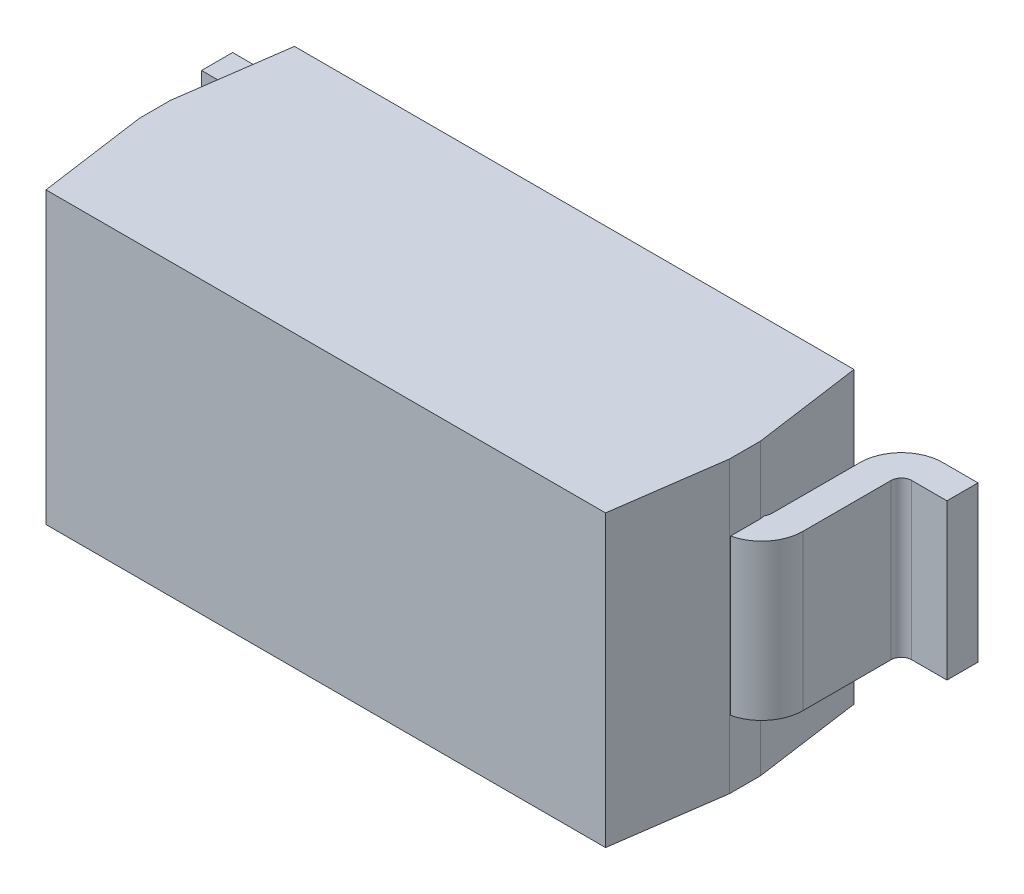
ISO-10303-21;
HEADER;
FILE_DESCRIPTION(('STEP AP214'),'2;1');
FILE_NAME('part.step','',(''),(''),'','','');
FILE_SCHEMA(('AUTOMOTIVE_DESIGN { 1 0 10303 214 1 1 1 1 }'));
ENDSEC;
DATA;
#1=APPLICATION_CONTEXT('core data for automotive mechanical design processes');
#2=APPLICATION_PROTOCOL_DEFINITION('international standard','automotive_design',2000,#1);
#3=PRODUCT_CONTEXT('',#1,'mechanical');
#4=PRODUCT('Part','Part','',(#3));
#5=PRODUCT_RELATED_PRODUCT_CATEGORY('part','',(#4));
#6=PRODUCT_DEFINITION_FORMATION('','',#4);
#7=PRODUCT_DEFINITION_CONTEXT('part definition',#1,'design');
#8=PRODUCT_DEFINITION('design','',#6,#7);
#9=PRODUCT_DEFINITION_SHAPE('','',#8);
#10=(LENGTH_UNIT() NAMED_UNIT(*) SI_UNIT(.MILLI.,.METRE.));
#11=(NAMED_UNIT(*) PLANE_ANGLE_UNIT() SI_UNIT($,.RADIAN.));
#12=(NAMED_UNIT(*) SI_UNIT($,.STERADIAN.) SOLID_ANGLE_UNIT());
#13=UNCERTAINTY_MEASURE_WITH_UNIT(LENGTH_MEASURE(1.E-05),#10,'distance_accuracy_value','');
#14=(GEOMETRIC_REPRESENTATION_CONTEXT(3) GLOBAL_UNCERTAINTY_ASSIGNED_CONTEXT((#13)) GLOBAL_UNIT_ASSIGNED_CONTEXT((#10,
#11,#12)) REPRESENTATION_CONTEXT('',''));
#15=CARTESIAN_POINT('',(0.,0.,0.));
#16=DIRECTION('',(0.,0.,1.));
#17=DIRECTION('',(1.,0.,0.));
#18=AXIS2_PLACEMENT_3D('',#15,#16,#17);
#19=CARTESIAN_POINT('',(1.425,0.,0.75));
#20=DIRECTION('',(-1.,0.,0.));
#21=DIRECTION('',(0.,0.,1.));
#22=AXIS2_PLACEMENT_3D('',#19,#20,#21);
#23=PLANE('',#22);
#24=DIRECTION('',(0.,0.,1.));
#25=VECTOR('',#24,1.);
#26=CARTESIAN_POINT('',(1.425,-0.7,0.75));
#27=LINE('',#26,#25);
#28=CARTESIAN_POINT('',(1.425,-0.7,0.675));
#29=VERTEX_POINT('',#28);
#30=CARTESIAN_POINT('',(1.425,-0.7,0.825));
#31=VERTEX_POINT('',#30);
#32=EDGE_CURVE('E368',#29,#31,#27,.T.);
#33=ORIENTED_EDGE('',*,*,#32,.F.);
#34=DIRECTION('',(0.,1.,0.));
#35=VECTOR('',#34,1.);
#36=CARTESIAN_POINT('',(1.425,0.,0.675));
#37=LINE('',#36,#35);
#38=CARTESIAN_POINT('',(1.425,-0.375,0.675));
#39=VERTEX_POINT('',#38);
#40=EDGE_CURVE('E341',#39,#29,#37,.F.);
#41=ORIENTED_EDGE('',*,*,#40,.F.);
#42=DIRECTION('',(0.,0.,1.));
#43=VECTOR('',#42,1.);
#44=CARTESIAN_POINT('',(1.425,-0.375,0.75));
#45=LINE('',#44,#43);
#46=CARTESIAN_POINT('',(1.425,-0.375,0.819871752699051));
#47=VERTEX_POINT('',#46);
#48=EDGE_CURVE('E335',#47,#39,#45,.F.);
#49=ORIENTED_EDGE('',*,*,#48,.F.);
#50=DIRECTION('',(0.,-1.,0.));
#51=VECTOR('',#50,1.);
#52=CARTESIAN_POINT('',(1.425,0.375,0.819871752699051));
#53=LINE('',#52,#51);
#54=CARTESIAN_POINT('',(1.425,0.375,0.819871752699051));
#55=VERTEX_POINT('',#54);
#56=EDGE_CURVE('E231',#55,#47,#53,.T.);
#57=ORIENTED_EDGE('',*,*,#56,.F.);
#58=DIRECTION('',(0.,0.,1.));
#59=VECTOR('',#58,1.);
#60=CARTESIAN_POINT('',(1.425,0.375,0.75));
#61=LINE('',#60,#59);
#62=CARTESIAN_POINT('',(1.425,0.375,0.675));
#63=VERTEX_POINT('',#62);
#64=EDGE_CURVE('E211',#63,#55,#61,.T.);
#65=ORIENTED_EDGE('',*,*,#64,.F.);
#66=DIRECTION('',(0.,1.,0.));
#67=VECTOR('',#66,1.);
#68=CARTESIAN_POINT('',(1.425,0.,0.675));
#69=LINE('',#68,#67);
#70=CARTESIAN_POINT('',(1.425,0.7,0.675));
#71=VERTEX_POINT('',#70);
#72=EDGE_CURVE('E336',#71,#63,#69,.F.);
#73=ORIENTED_EDGE('',*,*,#72,.F.);
#74=DIRECTION('',(0.,0.,1.));
#75=VECTOR('',#74,1.);
#76=CARTESIAN_POINT('',(1.425,0.7,0.75));
#77=LINE('',#76,#75);
#78=CARTESIAN_POINT('',(1.425,0.7,0.825));
#79=VERTEX_POINT('',#78);
#80=EDGE_CURVE('E394',#79,#71,#77,.F.);
#81=ORIENTED_EDGE('',*,*,#80,.F.);
#82=DIRECTION('',(0.,1.,0.));
#83=VECTOR('',#82,1.);
#84=CARTESIAN_POINT('',(1.425,0.,0.825));
#85=LINE('',#84,#83);
#86=EDGE_CURVE('E285',#31,#79,#85,.T.);
#87=ORIENTED_EDGE('',*,*,#86,.F.);
#88=EDGE_LOOP('',(#33,#41,#49,#57,#65,#73,#81,#87));
#89=FACE_BOUND('',#88,.T.);
#90=ADVANCED_FACE('F17',(#89),#23,.F.);
#91=CARTESIAN_POINT('',(-1.425,0.,0.75));
#92=DIRECTION('',(1.,0.,0.));
#93=DIRECTION('',(0.,0.,-1.));
#94=AXIS2_PLACEMENT_3D('',#91,#92,#93);
#95=PLANE('',#94);
#96=DIRECTION('',(0.,0.,-1.));
#97=VECTOR('',#96,1.);
#98=CARTESIAN_POINT('',(-1.425,0.7,0.75));
#99=LINE('',#98,#97);
#100=CARTESIAN_POINT('',(-1.425,0.7,0.675));
#101=VERTEX_POINT('',#100);
#102=CARTESIAN_POINT('',(-1.425,0.7,0.825000000000001));
#103=VERTEX_POINT('',#102);
#104=EDGE_CURVE('E317',#101,#103,#99,.F.);
#105=ORIENTED_EDGE('',*,*,#104,.F.);
#106=DIRECTION('',(0.,1.,0.));
#107=VECTOR('',#106,1.);
#108=CARTESIAN_POINT('',(-1.425,0.,0.675));
#109=LINE('',#108,#107);
#110=CARTESIAN_POINT('',(-1.425,0.375,0.675));
#111=VERTEX_POINT('',#110);
#112=EDGE_CURVE('E331',#111,#101,#109,.T.);
#113=ORIENTED_EDGE('',*,*,#112,.F.);
#114=DIRECTION('',(0.,0.,-1.));
#115=VECTOR('',#114,1.);
#116=CARTESIAN_POINT('',(-1.425,0.375,0.75));
#117=LINE('',#116,#115);
#118=CARTESIAN_POINT('',(-1.425,0.375,0.819871752699051));
#119=VERTEX_POINT('',#118);
#120=EDGE_CURVE('E325',#119,#111,#117,.T.);
#121=ORIENTED_EDGE('',*,*,#120,.F.);
#122=DIRECTION('',(0.,1.,0.));
#123=VECTOR('',#122,1.);
#124=CARTESIAN_POINT('',(-1.425,-0.375,0.819871752699051));
#125=LINE('',#124,#123);
#126=CARTESIAN_POINT('',(-1.425,-0.375,0.819871752699051));
#127=VERTEX_POINT('',#126);
#128=EDGE_CURVE('E272',#127,#119,#125,.T.);
#129=ORIENTED_EDGE('',*,*,#128,.F.);
#130=DIRECTION('',(0.,0.,-1.));
#131=VECTOR('',#130,1.);
#132=CARTESIAN_POINT('',(-1.425,-0.375,0.75));
#133=LINE('',#132,#131);
#134=CARTESIAN_POINT('',(-1.425,-0.375,0.675));
#135=VERTEX_POINT('',#134);
#136=EDGE_CURVE('E323',#135,#127,#133,.F.);
#137=ORIENTED_EDGE('',*,*,#136,.F.);
#138=DIRECTION('',(0.,1.,0.));
#139=VECTOR('',#138,1.);
#140=CARTESIAN_POINT('',(-1.425,0.,0.675));
#141=LINE('',#140,#139);
#142=CARTESIAN_POINT('',(-1.425,-0.7,0.675));
#143=VERTEX_POINT('',#142);
#144=EDGE_CURVE('E326',#143,#135,#141,.T.);
#145=ORIENTED_EDGE('',*,*,#144,.F.);
#146=DIRECTION('',(0.,0.,-1.));
#147=VECTOR('',#146,1.);
#148=CARTESIAN_POINT('',(-1.425,-0.7,0.75));
#149=LINE('',#148,#147);
#150=CARTESIAN_POINT('',(-1.425,-0.7,0.825000000000001));
#151=VERTEX_POINT('',#150);
#152=EDGE_CURVE('E358',#151,#143,#149,.T.);
#153=ORIENTED_EDGE('',*,*,#152,.F.);
#154=DIRECTION('',(0.,1.,0.));
#155=VECTOR('',#154,1.);
#156=CARTESIAN_POINT('',(-1.425,0.,0.825));
#157=LINE('',#156,#155);
#158=EDGE_CURVE('E284',#103,#151,#157,.F.);
#159=ORIENTED_EDGE('',*,*,#158,.F.);
#160=EDGE_LOOP('',(#105,#113,#121,#129,#137,#145,#153,#159));
#161=FACE_BOUND('',#160,.T.);
#162=ADVANCED_FACE('F665',(#161),#95,.F.);
#163=CARTESIAN_POINT('',(1.38,0.375,0.625));
#164=DIRECTION('',(0.,-1.,0.));
#165=DIRECTION('',(0.,0.,-1.));
#166=AXIS2_PLACEMENT_3D('',#163,#164,#165);
#167=CYLINDRICAL_SURFACE('',#166,0.2);
#168=CARTESIAN_POINT('',(1.38,-0.375,0.625));
#169=DIRECTION('',(0.,-1.,0.));
#170=DIRECTION('',(0.,0.,-1.));
#171=AXIS2_PLACEMENT_3D('',#168,#169,#170);
#172=CIRCLE('',#171,0.2);
#173=CARTESIAN_POINT('',(1.58,-0.375,0.625));
#174=VERTEX_POINT('',#173);
#175=EDGE_CURVE('E226',#47,#174,#172,.F.);
#176=ORIENTED_EDGE('',*,*,#175,.T.);
#177=DIRECTION('',(0.,1.,0.));
#178=VECTOR('',#177,1.);
#179=CARTESIAN_POINT('',(1.58,0.375,0.625));
#180=LINE('',#179,#178);
#181=CARTESIAN_POINT('',(1.58,0.375,0.625));
#182=VERTEX_POINT('',#181);
#183=EDGE_CURVE('E223',#182,#174,#180,.F.);
#184=ORIENTED_EDGE('',*,*,#183,.F.);
#185=CARTESIAN_POINT('',(1.38,0.375,0.625));
#186=DIRECTION('',(0.,-1.,0.));
#187=DIRECTION('',(0.,0.,-1.));
#188=AXIS2_PLACEMENT_3D('',#185,#186,#187);
#189=CIRCLE('',#188,0.2);
#190=EDGE_CURVE('E20',#55,#182,#189,.F.);
#191=ORIENTED_EDGE('',*,*,#190,.F.);
#192=ORIENTED_EDGE('',*,*,#56,.T.);
#193=EDGE_LOOP('',(#176,#184,#191,#192));
#194=FACE_BOUND('',#193,.T.);
#195=ADVANCED_FACE('F224',(#194),#167,.T.);
#196=CARTESIAN_POINT('',(1.58,0.375,0.2));
#197=DIRECTION('',(1.,0.,0.));
#198=DIRECTION('',(0.,0.,-1.));
#199=AXIS2_PLACEMENT_3D('',#196,#197,#198);
#200=PLANE('',#199);
#201=DIRECTION('',(0.,0.,1.));
#202=VECTOR('',#201,1.);
#203=CARTESIAN_POINT('',(1.58,-0.375,0.825));
#204=LINE('',#203,#202);
#205=CARTESIAN_POINT('',(1.58,-0.375,0.2));
#206=VERTEX_POINT('',#205);
#207=EDGE_CURVE('E449',#174,#206,#204,.F.);
#208=ORIENTED_EDGE('',*,*,#207,.T.);
#209=DIRECTION('',(0.,-1.,0.));
#210=VECTOR('',#209,1.);
#211=CARTESIAN_POINT('',(1.58,0.375,0.2));
#212=LINE('',#211,#210);
#213=CARTESIAN_POINT('',(1.58,0.375,0.2));
#214=VERTEX_POINT('',#213);
#215=EDGE_CURVE('E230',#206,#214,#212,.F.);
#216=ORIENTED_EDGE('',*,*,#215,.T.);
#217=DIRECTION('',(0.,0.,1.));
#218=VECTOR('',#217,1.);
#219=CARTESIAN_POINT('',(1.58,0.375,0.825));
#220=LINE('',#219,#218);
#221=EDGE_CURVE('E217',#182,#214,#220,.F.);
#222=ORIENTED_EDGE('',*,*,#221,.F.);
#223=ORIENTED_EDGE('',*,*,#183,.T.);
#224=EDGE_LOOP('',(#208,#216,#222,#223));
#225=FACE_BOUND('',#224,.T.);
#226=ADVANCED_FACE('F233',(#225),#200,.T.);
#227=CARTESIAN_POINT('',(1.63,0.375,0.2));
#228=DIRECTION('',(0.,-1.,0.));
#229=DIRECTION('',(0.,0.,-1.));
#230=AXIS2_PLACEMENT_3D('',#227,#228,#229);
#231=CYLINDRICAL_SURFACE('',#230,0.05);
#232=ORIENTED_EDGE('',*,*,#215,.F.);
#233=CARTESIAN_POINT('',(1.63,-0.375,0.2));
#234=DIRECTION('',(0.,-1.,0.));
#235=DIRECTION('',(0.,0.,-1.));
#236=AXIS2_PLACEMENT_3D('',#233,#234,#235);
#237=CIRCLE('',#236,0.05);
#238=CARTESIAN_POINT('',(1.63,-0.375,0.15));
#239=VERTEX_POINT('',#238);
#240=EDGE_CURVE('E446',#206,#239,#237,.T.);
#241=ORIENTED_EDGE('',*,*,#240,.T.);
#242=DIRECTION('',(0.,-1.,0.));
#243=VECTOR('',#242,1.);
#244=CARTESIAN_POINT('',(1.63,0.375,0.15));
#245=LINE('',#244,#243);
#246=CARTESIAN_POINT('',(1.63,0.375,0.15));
#247=VERTEX_POINT('',#246);
#248=EDGE_CURVE('E311',#247,#239,#245,.T.);
#249=ORIENTED_EDGE('',*,*,#248,.F.);
#250=CARTESIAN_POINT('',(1.63,0.375,0.2));
#251=DIRECTION('',(0.,-1.,0.));
#252=DIRECTION('',(0.,0.,-1.));
#253=AXIS2_PLACEMENT_3D('',#250,#251,#252);
#254=CIRCLE('',#253,0.05);
#255=EDGE_CURVE('E235',#214,#247,#254,.T.);
#256=ORIENTED_EDGE('',*,*,#255,.F.);
#257=EDGE_LOOP('',(#232,#241,#249,#256));
#258=FACE_BOUND('',#257,.T.);
#259=ADVANCED_FACE('F658',(#258),#231,.F.);
#260=CARTESIAN_POINT('',(1.8,0.375,0.15));
#261=DIRECTION('',(0.,0.,1.));
#262=DIRECTION('',(0.,-1.,0.));
#263=AXIS2_PLACEMENT_3D('',#260,#261,#262);
#264=PLANE('',#263);
#265=DIRECTION('',(1.,0.,0.));
#266=VECTOR('',#265,1.);
#267=CARTESIAN_POINT('',(1.425,-0.375,0.15));
#268=LINE('',#267,#266);
#269=CARTESIAN_POINT('',(1.8,-0.375,0.15));
#270=VERTEX_POINT('',#269);
#271=EDGE_CURVE('E307',#239,#270,#268,.T.);
#272=ORIENTED_EDGE('',*,*,#271,.T.);
#273=DIRECTION('',(0.,1.,0.));
#274=VECTOR('',#273,1.);
#275=CARTESIAN_POINT('',(1.8,0.375,0.15));
#276=LINE('',#275,#274);
#277=CARTESIAN_POINT('',(1.8,0.375,0.15));
#278=VERTEX_POINT('',#277);
#279=EDGE_CURVE('E300',#278,#270,#276,.F.);
#280=ORIENTED_EDGE('',*,*,#279,.F.);
#281=DIRECTION('',(1.,0.,0.));
#282=VECTOR('',#281,1.);
#283=CARTESIAN_POINT('',(1.425,0.375,0.15));
#284=LINE('',#283,#282);
#285=EDGE_CURVE('E237',#247,#278,#284,.T.);
#286=ORIENTED_EDGE('',*,*,#285,.F.);
#287=ORIENTED_EDGE('',*,*,#248,.T.);
#288=EDGE_LOOP('',(#272,#280,#286,#287));
#289=FACE_BOUND('',#288,.T.);
#290=ADVANCED_FACE('F470',(#289),#264,.T.);
#291=CARTESIAN_POINT('',(1.8,0.375,0.));
#292=DIRECTION('',(1.,0.,0.));
#293=DIRECTION('',(0.,0.,-1.));
#294=AXIS2_PLACEMENT_3D('',#291,#292,#293);
#295=PLANE('',#294);
#296=DIRECTION('',(0.,0.,1.));
#297=VECTOR('',#296,1.);
#298=CARTESIAN_POINT('',(1.8,-0.375,0.825));
#299=LINE('',#298,#297);
#300=CARTESIAN_POINT('',(1.8,-0.375,0.));
#301=VERTEX_POINT('',#300);
#302=EDGE_CURVE('E303',#270,#301,#299,.F.);
#303=ORIENTED_EDGE('',*,*,#302,.T.);
#304=DIRECTION('',(0.,1.,0.));
#305=VECTOR('',#304,1.);
#306=CARTESIAN_POINT('',(1.8,0.375,0.));
#307=LINE('',#306,#305);
#308=CARTESIAN_POINT('',(1.8,0.375,0.));
#309=VERTEX_POINT('',#308);
#310=EDGE_CURVE('E298',#309,#301,#307,.F.);
#311=ORIENTED_EDGE('',*,*,#310,.F.);
#312=DIRECTION('',(0.,0.,1.));
#313=VECTOR('',#312,1.);
#314=CARTESIAN_POINT('',(1.8,0.375,0.825));
#315=LINE('',#314,#313);
#316=EDGE_CURVE('E318',#278,#309,#315,.F.);
#317=ORIENTED_EDGE('',*,*,#316,.F.);
#318=ORIENTED_EDGE('',*,*,#279,.T.);
#319=EDGE_LOOP('',(#303,#311,#317,#318));
#320=FACE_BOUND('',#319,.T.);
#321=ADVANCED_FACE('F474',(#320),#295,.T.);
#322=CARTESIAN_POINT('',(1.63,0.375,0.));
#323=DIRECTION('',(0.,0.,-1.));
#324=DIRECTION('',(0.,1.,0.));
#325=AXIS2_PLACEMENT_3D('',#322,#323,#324);
#326=PLANE('',#325);
#327=DIRECTION('',(1.,0.,0.));
#328=VECTOR('',#327,1.);
#329=CARTESIAN_POINT('',(1.425,-0.375,0.));
#330=LINE('',#329,#328);
#331=CARTESIAN_POINT('',(1.63,-0.375,0.));
#332=VERTEX_POINT('',#331);
#333=EDGE_CURVE('E306',#301,#332,#330,.F.);
#334=ORIENTED_EDGE('',*,*,#333,.T.);
#335=DIRECTION('',(0.,-1.,0.));
#336=VECTOR('',#335,1.);
#337=CARTESIAN_POINT('',(1.63,0.375,0.));
#338=LINE('',#337,#336);
#339=CARTESIAN_POINT('',(1.63,0.375,0.));
#340=VERTEX_POINT('',#339);
#341=EDGE_CURVE('E296',#340,#332,#338,.T.);
#342=ORIENTED_EDGE('',*,*,#341,.F.);
#343=DIRECTION('',(1.,0.,0.));
#344=VECTOR('',#343,1.);
#345=CARTESIAN_POINT('',(1.425,0.375,0.));
#346=LINE('',#345,#344);
#347=EDGE_CURVE('E320',#309,#340,#346,.F.);
#348=ORIENTED_EDGE('',*,*,#347,.F.);
#349=ORIENTED_EDGE('',*,*,#310,.T.);
#350=EDGE_LOOP('',(#334,#342,#348,#349));
#351=FACE_BOUND('',#350,.T.);
#352=ADVANCED_FACE('F478',(#351),#326,.T.);
#353=CARTESIAN_POINT('',(1.63,0.375,0.2));
#354=DIRECTION('',(0.,-1.,0.));
#355=DIRECTION('',(0.,0.,-1.));
#356=AXIS2_PLACEMENT_3D('',#353,#354,#355);
#357=CYLINDRICAL_SURFACE('',#356,0.2);
#358=CARTESIAN_POINT('',(1.63,-0.375,0.2));
#359=DIRECTION('',(0.,-1.,0.));
#360=DIRECTION('',(0.,0.,-1.));
#361=AXIS2_PLACEMENT_3D('',#358,#359,#360);
#362=CIRCLE('',#361,0.2);
#363=CARTESIAN_POINT('',(1.43,-0.375,0.2));
#364=VERTEX_POINT('',#363);
#365=EDGE_CURVE('E443',#332,#364,#362,.F.);
#366=ORIENTED_EDGE('',*,*,#365,.T.);
#367=DIRECTION('',(0.,1.,0.));
#368=VECTOR('',#367,1.);
#369=CARTESIAN_POINT('',(1.43,0.375,0.2));
#370=LINE('',#369,#368);
#371=CARTESIAN_POINT('',(1.43,0.375,0.2));
#372=VERTEX_POINT('',#371);
#373=EDGE_CURVE('E294',#372,#364,#370,.F.);
#374=ORIENTED_EDGE('',*,*,#373,.F.);
#375=CARTESIAN_POINT('',(1.63,0.375,0.2));
#376=DIRECTION('',(0.,-1.,0.));
#377=DIRECTION('',(0.,0.,-1.));
#378=AXIS2_PLACEMENT_3D('',#375,#376,#377);
#379=CIRCLE('',#378,0.2);
#380=EDGE_CURVE('E453',#340,#372,#379,.F.);
#381=ORIENTED_EDGE('',*,*,#380,.F.);
#382=ORIENTED_EDGE('',*,*,#341,.T.);
#383=EDGE_LOOP('',(#366,#374,#381,#382));
#384=FACE_BOUND('',#383,.T.);
#385=ADVANCED_FACE('F481',(#384),#357,.T.);
#386=CARTESIAN_POINT('',(1.43,0.375,0.625));
#387=DIRECTION('',(-1.,0.,0.));
#388=DIRECTION('',(0.,0.,1.));
#389=AXIS2_PLACEMENT_3D('',#386,#387,#388);
#390=PLANE('',#389);
#391=DIRECTION('',(0.,0.,1.));
#392=VECTOR('',#391,1.);
#393=CARTESIAN_POINT('',(1.43,-0.375,0.825));
#394=LINE('',#393,#392);
#395=CARTESIAN_POINT('',(1.43,-0.375,0.625));
#396=VERTEX_POINT('',#395);
#397=EDGE_CURVE('E442',#364,#396,#394,.T.);
#398=ORIENTED_EDGE('',*,*,#397,.T.);
#399=DIRECTION('',(0.,-1.,0.));
#400=VECTOR('',#399,1.);
#401=CARTESIAN_POINT('',(1.43,0.375,0.625));
#402=LINE('',#401,#400);
#403=CARTESIAN_POINT('',(1.43,0.375,0.625));
#404=VERTEX_POINT('',#403);
#405=EDGE_CURVE('E289',#396,#404,#402,.F.);
#406=ORIENTED_EDGE('',*,*,#405,.T.);
#407=DIRECTION('',(0.,0.,1.));
#408=VECTOR('',#407,1.);
#409=CARTESIAN_POINT('',(1.43,0.375,0.825));
#410=LINE('',#409,#408);
#411=EDGE_CURVE('E293',#372,#404,#410,.T.);
#412=ORIENTED_EDGE('',*,*,#411,.F.);
#413=ORIENTED_EDGE('',*,*,#373,.T.);
#414=EDGE_LOOP('',(#398,#406,#412,#413));
#415=FACE_BOUND('',#414,.T.);
#416=ADVANCED_FACE('F486',(#415),#390,.T.);
#417=CARTESIAN_POINT('',(1.38810803089062,0.,1.0875));
#418=DIRECTION('',(0.99026806874157,0.,0.139173100960066));
#419=DIRECTION('',(0.139173100960066,0.,-0.99026806874157));
#420=AXIS2_PLACEMENT_3D('',#417,#418,#419);
#421=PLANE('',#420);
#422=DIRECTION('',(0.139173100960066,0.,-0.99026806874157));
#423=VECTOR('',#422,1.);
#424=CARTESIAN_POINT('',(1.38810803089062,-0.7,1.0875));
#425=LINE('',#424,#423);
#426=CARTESIAN_POINT('',(1.35121606178124,-0.7,1.35));
#427=VERTEX_POINT('',#426);
#428=EDGE_CURVE('E286',#427,#31,#425,.T.);
#429=ORIENTED_EDGE('',*,*,#428,.T.);
#430=ORIENTED_EDGE('',*,*,#86,.T.);
#431=DIRECTION('',(0.139173100960066,0.,-0.99026806874157));
#432=VECTOR('',#431,1.);
#433=CARTESIAN_POINT('',(1.38810803089062,0.7,1.0875));
#434=LINE('',#433,#432);
#435=CARTESIAN_POINT('',(1.35121606178124,0.7,1.35));
#436=VERTEX_POINT('',#435);
#437=EDGE_CURVE('E288',#79,#436,#434,.F.);
#438=ORIENTED_EDGE('',*,*,#437,.T.);
#439=DIRECTION('',(0.,1.,0.));
#440=VECTOR('',#439,1.);
#441=CARTESIAN_POINT('',(1.35121606178124,0.,1.35));
#442=LINE('',#441,#440);
#443=EDGE_CURVE('E441',#436,#427,#442,.F.);
#444=ORIENTED_EDGE('',*,*,#443,.T.);
#445=EDGE_LOOP('',(#429,#430,#438,#444));
#446=FACE_BOUND('',#445,.T.);
#447=ADVANCED_FACE('F643',(#446),#421,.T.);
#448=CARTESIAN_POINT('',(-1.38810803089062,0.,1.0875));
#449=DIRECTION('',(-0.99026806874157,0.,0.139173100960065));
#450=DIRECTION('',(0.139173100960065,0.,0.99026806874157));
#451=AXIS2_PLACEMENT_3D('',#448,#449,#450);
#452=PLANE('',#451);
#453=DIRECTION('',(0.139173100960065,0.,0.99026806874157));
#454=VECTOR('',#453,1.);
#455=CARTESIAN_POINT('',(-1.38810803089062,-0.7,1.0875));
#456=LINE('',#455,#454);
#457=CARTESIAN_POINT('',(-1.35121606178124,-0.7,1.35));
#458=VERTEX_POINT('',#457);
#459=EDGE_CURVE('E275',#151,#458,#456,.T.);
#460=ORIENTED_EDGE('',*,*,#459,.T.);
#461=DIRECTION('',(0.,1.,0.));
#462=VECTOR('',#461,1.);
#463=CARTESIAN_POINT('',(-1.35121606178124,0.,1.35));
#464=LINE('',#463,#462);
#465=CARTESIAN_POINT('',(-1.35121606178124,0.7,1.35));
#466=VERTEX_POINT('',#465);
#467=EDGE_CURVE('E437',#458,#466,#464,.T.);
#468=ORIENTED_EDGE('',*,*,#467,.T.);
#469=DIRECTION('',(0.139173100960065,0.,0.99026806874157));
#470=VECTOR('',#469,1.);
#471=CARTESIAN_POINT('',(-1.38810803089062,0.7,1.0875));
#472=LINE('',#471,#470);
#473=EDGE_CURVE('E282',#466,#103,#472,.F.);
#474=ORIENTED_EDGE('',*,*,#473,.T.);
#475=ORIENTED_EDGE('',*,*,#158,.T.);
#476=EDGE_LOOP('',(#460,#468,#474,#475));
#477=FACE_BOUND('',#476,.T.);
#478=ADVANCED_FACE('F639',(#477),#452,.T.);
#479=CARTESIAN_POINT('',(-1.38,-0.375,0.625));
#480=DIRECTION('',(0.,1.,0.));
#481=DIRECTION('',(-1.,0.,0.));
#482=AXIS2_PLACEMENT_3D('',#479,#480,#481);
#483=CYLINDRICAL_SURFACE('',#482,0.2);
#484=CARTESIAN_POINT('',(-1.38,0.375,0.625));
#485=DIRECTION('',(0.,1.,0.));
#486=DIRECTION('',(-1.,0.,0.));
#487=AXIS2_PLACEMENT_3D('',#484,#485,#486);
#488=CIRCLE('',#487,0.2);
#489=CARTESIAN_POINT('',(-1.58,0.375,0.625));
#490=VERTEX_POINT('',#489);
#491=EDGE_CURVE('E425',#119,#490,#488,.F.);
#492=ORIENTED_EDGE('',*,*,#491,.T.);
#493=DIRECTION('',(0.,-1.,0.));
#494=VECTOR('',#493,1.);
#495=CARTESIAN_POINT('',(-1.58,-0.375,0.625));
#496=LINE('',#495,#494);
#497=CARTESIAN_POINT('',(-1.58,-0.375,0.625));
#498=VERTEX_POINT('',#497);
#499=EDGE_CURVE('E270',#498,#490,#496,.F.);
#500=ORIENTED_EDGE('',*,*,#499,.F.);
#501=CARTESIAN_POINT('',(-1.38,-0.375,0.625));
#502=DIRECTION('',(0.,1.,0.));
#503=DIRECTION('',(-1.,0.,0.));
#504=AXIS2_PLACEMENT_3D('',#501,#502,#503);
#505=CIRCLE('',#504,0.2);
#506=EDGE_CURVE('E435',#127,#498,#505,.F.);
#507=ORIENTED_EDGE('',*,*,#506,.F.);
#508=ORIENTED_EDGE('',*,*,#128,.T.);
#509=EDGE_LOOP('',(#492,#500,#507,#508));
#510=FACE_BOUND('',#509,.T.);
#511=ADVANCED_FACE('F635',(#510),#483,.T.);
#512=CARTESIAN_POINT('',(-1.58,-0.375,0.2));
#513=DIRECTION('',(-1.,0.,0.));
#514=DIRECTION('',(0.,-1.,0.));
#515=AXIS2_PLACEMENT_3D('',#512,#513,#514);
#516=PLANE('',#515);
#517=DIRECTION('',(0.,0.,1.));
#518=VECTOR('',#517,1.);
#519=CARTESIAN_POINT('',(-1.58,0.375,0.825));
#520=LINE('',#519,#518);
#521=CARTESIAN_POINT('',(-1.58,0.375,0.2));
#522=VERTEX_POINT('',#521);
#523=EDGE_CURVE('E424',#490,#522,#520,.F.);
#524=ORIENTED_EDGE('',*,*,#523,.T.);
#525=DIRECTION('',(0.,1.,0.));
#526=VECTOR('',#525,1.);
#527=CARTESIAN_POINT('',(-1.58,-0.375,0.2));
#528=LINE('',#527,#526);
#529=CARTESIAN_POINT('',(-1.58,-0.375,0.2));
#530=VERTEX_POINT('',#529);
#531=EDGE_CURVE('E267',#522,#530,#528,.F.);
#532=ORIENTED_EDGE('',*,*,#531,.T.);
#533=DIRECTION('',(0.,0.,1.));
#534=VECTOR('',#533,1.);
#535=CARTESIAN_POINT('',(-1.58,-0.375,0.825));
#536=LINE('',#535,#534);
#537=EDGE_CURVE('E434',#498,#530,#536,.F.);
#538=ORIENTED_EDGE('',*,*,#537,.F.);
#539=ORIENTED_EDGE('',*,*,#499,.T.);
#540=EDGE_LOOP('',(#524,#532,#538,#539));
#541=FACE_BOUND('',#540,.T.);
#542=ADVANCED_FACE('F631',(#541),#516,.T.);
#543=CARTESIAN_POINT('',(-1.63,-0.375,0.2));
#544=DIRECTION('',(0.,1.,0.));
#545=DIRECTION('',(-1.,0.,0.));
#546=AXIS2_PLACEMENT_3D('',#543,#544,#545);
#547=CYLINDRICAL_SURFACE('',#546,0.05);
#548=ORIENTED_EDGE('',*,*,#531,.F.);
#549=CARTESIAN_POINT('',(-1.63,0.375,0.2));
#550=DIRECTION('',(0.,1.,0.));
#551=DIRECTION('',(-1.,0.,0.));
#552=AXIS2_PLACEMENT_3D('',#549,#550,#551);
#553=CIRCLE('',#552,0.05);
#554=CARTESIAN_POINT('',(-1.63,0.375,0.15));
#555=VERTEX_POINT('',#554);
#556=EDGE_CURVE('E421',#522,#555,#553,.T.);
#557=ORIENTED_EDGE('',*,*,#556,.T.);
#558=DIRECTION('',(0.,-1.,0.));
#559=VECTOR('',#558,1.);
#560=CARTESIAN_POINT('',(-1.63,-0.375,0.15));
#561=LINE('',#560,#559);
#562=CARTESIAN_POINT('',(-1.63,-0.375,0.15));
#563=VERTEX_POINT('',#562);
#564=EDGE_CURVE('E263',#563,#555,#561,.F.);
#565=ORIENTED_EDGE('',*,*,#564,.F.);
#566=CARTESIAN_POINT('',(-1.63,-0.375,0.2));
#567=DIRECTION('',(0.,1.,0.));
#568=DIRECTION('',(-1.,0.,0.));
#569=AXIS2_PLACEMENT_3D('',#566,#567,#568);
#570=CIRCLE('',#569,0.05);
#571=EDGE_CURVE('E432',#530,#563,#570,.T.);
#572=ORIENTED_EDGE('',*,*,#571,.F.);
#573=EDGE_LOOP('',(#548,#557,#565,#572));
#574=FACE_BOUND('',#573,.T.);
#575=ADVANCED_FACE('F627',(#574),#547,.F.);
#576=CARTESIAN_POINT('',(-1.8,-0.375,0.15));
#577=DIRECTION('',(0.,0.,1.));
#578=DIRECTION('',(0.,-1.,0.));
#579=AXIS2_PLACEMENT_3D('',#576,#577,#578);
#580=PLANE('',#579);
#581=DIRECTION('',(1.,0.,0.));
#582=VECTOR('',#581,1.);
#583=CARTESIAN_POINT('',(-1.425,0.375,0.15));
#584=LINE('',#583,#582);
#585=CARTESIAN_POINT('',(-1.8,0.375,0.15));
#586=VERTEX_POINT('',#585);
#587=EDGE_CURVE('E259',#555,#586,#584,.F.);
#588=ORIENTED_EDGE('',*,*,#587,.T.);
#589=DIRECTION('',(0.,-1.,0.));
#590=VECTOR('',#589,1.);
#591=CARTESIAN_POINT('',(-1.8,-0.375,0.15));
#592=LINE('',#591,#590);
#593=CARTESIAN_POINT('',(-1.8,-0.375,0.15));
#594=VERTEX_POINT('',#593);
#595=EDGE_CURVE('E252',#594,#586,#592,.F.);
#596=ORIENTED_EDGE('',*,*,#595,.F.);
#597=DIRECTION('',(1.,0.,0.));
#598=VECTOR('',#597,1.);
#599=CARTESIAN_POINT('',(-1.425,-0.375,0.15));
#600=LINE('',#599,#598);
#601=EDGE_CURVE('E279',#563,#594,#600,.F.);
#602=ORIENTED_EDGE('',*,*,#601,.F.);
#603=ORIENTED_EDGE('',*,*,#564,.T.);
#604=EDGE_LOOP('',(#588,#596,#602,#603));
#605=FACE_BOUND('',#604,.T.);
#606=ADVANCED_FACE('F623',(#605),#580,.T.);
#607=CARTESIAN_POINT('',(-1.8,-0.375,0.));
#608=DIRECTION('',(-1.,0.,0.));
#609=DIRECTION('',(0.,-1.,0.));
#610=AXIS2_PLACEMENT_3D('',#607,#608,#609);
#611=PLANE('',#610);
#612=DIRECTION('',(0.,0.,1.));
#613=VECTOR('',#612,1.);
#614=CARTESIAN_POINT('',(-1.8,0.375,0.825));
#615=LINE('',#614,#613);
#616=CARTESIAN_POINT('',(-1.8,0.375,0.));
#617=VERTEX_POINT('',#616);
#618=EDGE_CURVE('E255',#586,#617,#615,.F.);
#619=ORIENTED_EDGE('',*,*,#618,.T.);
#620=DIRECTION('',(0.,1.,0.));
#621=VECTOR('',#620,1.);
#622=CARTESIAN_POINT('',(-1.8,-0.375,0.));
#623=LINE('',#622,#621);
#624=CARTESIAN_POINT('',(-1.8,-0.375,0.));
#625=VERTEX_POINT('',#624);
#626=EDGE_CURVE('E250',#625,#617,#623,.T.);
#627=ORIENTED_EDGE('',*,*,#626,.F.);
#628=DIRECTION('',(0.,0.,1.));
#629=VECTOR('',#628,1.);
#630=CARTESIAN_POINT('',(-1.8,-0.375,0.825));
#631=LINE('',#630,#629);
#632=EDGE_CURVE('E276',#594,#625,#631,.F.);
#633=ORIENTED_EDGE('',*,*,#632,.F.);
#634=ORIENTED_EDGE('',*,*,#595,.T.);
#635=EDGE_LOOP('',(#619,#627,#633,#634));
#636=FACE_BOUND('',#635,.T.);
#637=ADVANCED_FACE('F619',(#636),#611,.T.);
#638=CARTESIAN_POINT('',(-1.63,-0.375,0.));
#639=DIRECTION('',(0.,0.,-1.));
#640=DIRECTION('',(0.,1.,0.));
#641=AXIS2_PLACEMENT_3D('',#638,#639,#640);
#642=PLANE('',#641);
#643=DIRECTION('',(1.,0.,0.));
#644=VECTOR('',#643,1.);
#645=CARTESIAN_POINT('',(-1.425,0.375,0.));
#646=LINE('',#645,#644);
#647=CARTESIAN_POINT('',(-1.63,0.375,0.));
#648=VERTEX_POINT('',#647);
#649=EDGE_CURVE('E258',#617,#648,#646,.T.);
#650=ORIENTED_EDGE('',*,*,#649,.T.);
#651=DIRECTION('',(0.,1.,0.));
#652=VECTOR('',#651,1.);
#653=CARTESIAN_POINT('',(-1.63,-0.375,0.));
#654=LINE('',#653,#652);
#655=CARTESIAN_POINT('',(-1.63,-0.375,0.));
#656=VERTEX_POINT('',#655);
#657=EDGE_CURVE('E248',#656,#648,#654,.T.);
#658=ORIENTED_EDGE('',*,*,#657,.F.);
#659=DIRECTION('',(1.,0.,0.));
#660=VECTOR('',#659,1.);
#661=CARTESIAN_POINT('',(-1.425,-0.375,0.));
#662=LINE('',#661,#660);
#663=EDGE_CURVE('E278',#625,#656,#662,.T.);
#664=ORIENTED_EDGE('',*,*,#663,.F.);
#665=ORIENTED_EDGE('',*,*,#626,.T.);
#666=EDGE_LOOP('',(#650,#658,#664,#665));
#667=FACE_BOUND('',#666,.T.);
#668=ADVANCED_FACE('F615',(#667),#642,.T.);
#669=CARTESIAN_POINT('',(-1.63,-0.375,0.2));
#670=DIRECTION('',(0.,1.,0.));
#671=DIRECTION('',(-1.,0.,0.));
#672=AXIS2_PLACEMENT_3D('',#669,#670,#671);
#673=CYLINDRICAL_SURFACE('',#672,0.2);
#674=CARTESIAN_POINT('',(-1.63,0.375,0.2));
#675=DIRECTION('',(0.,1.,0.));
#676=DIRECTION('',(-1.,0.,0.));
#677=AXIS2_PLACEMENT_3D('',#674,#675,#676);
#678=CIRCLE('',#677,0.2);
#679=CARTESIAN_POINT('',(-1.43,0.375,0.2));
#680=VERTEX_POINT('',#679);
#681=EDGE_CURVE('E418',#648,#680,#678,.F.);
#682=ORIENTED_EDGE('',*,*,#681,.T.);
#683=DIRECTION('',(0.,1.,0.));
#684=VECTOR('',#683,1.);
#685=CARTESIAN_POINT('',(-1.43,-0.375,0.2));
#686=LINE('',#685,#684);
#687=CARTESIAN_POINT('',(-1.43,-0.375,0.2));
#688=VERTEX_POINT('',#687);
#689=EDGE_CURVE('E221',#688,#680,#686,.T.);
#690=ORIENTED_EDGE('',*,*,#689,.F.);
#691=CARTESIAN_POINT('',(-1.63,-0.375,0.2));
#692=DIRECTION('',(0.,1.,0.));
#693=DIRECTION('',(-1.,0.,0.));
#694=AXIS2_PLACEMENT_3D('',#691,#692,#693);
#695=CIRCLE('',#694,0.2);
#696=EDGE_CURVE('E430',#656,#688,#695,.F.);
#697=ORIENTED_EDGE('',*,*,#696,.F.);
#698=ORIENTED_EDGE('',*,*,#657,.T.);
#699=EDGE_LOOP('',(#682,#690,#697,#698));
#700=FACE_BOUND('',#699,.T.);
#701=ADVANCED_FACE('F611',(#700),#673,.T.);
#702=CARTESIAN_POINT('',(-1.43,-0.375,0.625));
#703=DIRECTION('',(1.,0.,0.));
#704=DIRECTION('',(0.,1.,0.));
#705=AXIS2_PLACEMENT_3D('',#702,#703,#704);
#706=PLANE('',#705);
#707=DIRECTION('',(0.,0.,1.));
#708=VECTOR('',#707,1.);
#709=CARTESIAN_POINT('',(-1.43,0.375,0.825));
#710=LINE('',#709,#708);
#711=CARTESIAN_POINT('',(-1.43,0.375,0.625));
#712=VERTEX_POINT('',#711);
#713=EDGE_CURVE('E417',#680,#712,#710,.T.);
#714=ORIENTED_EDGE('',*,*,#713,.T.);
#715=DIRECTION('',(0.,1.,0.));
#716=VECTOR('',#715,1.);
#717=CARTESIAN_POINT('',(-1.43,-0.375,0.625));
#718=LINE('',#717,#716);
#719=CARTESIAN_POINT('',(-1.43,-0.375,0.625));
#720=VERTEX_POINT('',#719);
#721=EDGE_CURVE('E242',#712,#720,#718,.F.);
#722=ORIENTED_EDGE('',*,*,#721,.T.);
#723=DIRECTION('',(0.,0.,1.));
#724=VECTOR('',#723,1.);
#725=CARTESIAN_POINT('',(-1.43,-0.375,0.825));
#726=LINE('',#725,#724);
#727=EDGE_CURVE('E246',#688,#720,#726,.T.);
#728=ORIENTED_EDGE('',*,*,#727,.F.);
#729=ORIENTED_EDGE('',*,*,#689,.T.);
#730=EDGE_LOOP('',(#714,#722,#728,#729));
#731=FACE_BOUND('',#730,.T.);
#732=ADVANCED_FACE('F608',(#731),#706,.T.);
#733=CARTESIAN_POINT('',(1.425,0.375,0.825));
#734=DIRECTION('',(0.,1.,0.));
#735=DIRECTION('',(0.,0.,1.));
#736=AXIS2_PLACEMENT_3D('',#733,#734,#735);
#737=PLANE('',#736);
#738=ORIENTED_EDGE('',*,*,#411,.T.);
#739=CARTESIAN_POINT('',(1.38,0.375,0.625));
#740=DIRECTION('',(0.,-1.,0.));
#741=DIRECTION('',(0.,0.,-1.));
#742=AXIS2_PLACEMENT_3D('',#739,#740,#741);
#743=CIRCLE('',#742,0.05);
#744=CARTESIAN_POINT('',(1.42182380177004,0.375,0.652400175282288));
#745=VERTEX_POINT('',#744);
#746=EDGE_CURVE('E292',#404,#745,#743,.T.);
#747=ORIENTED_EDGE('',*,*,#746,.T.);
#748=DIRECTION('',(-0.139173100960066,0.,-0.99026806874157));
#749=VECTOR('',#748,1.);
#750=CARTESIAN_POINT('',(1.38810803089062,0.375,0.4125));
#751=LINE('',#750,#749);
#752=EDGE_CURVE('E496',#63,#745,#751,.T.);
#753=ORIENTED_EDGE('',*,*,#752,.F.);
#754=ORIENTED_EDGE('',*,*,#64,.T.);
#755=ORIENTED_EDGE('',*,*,#190,.T.);
#756=ORIENTED_EDGE('',*,*,#221,.T.);
#757=ORIENTED_EDGE('',*,*,#255,.T.);
#758=ORIENTED_EDGE('',*,*,#285,.T.);
#759=ORIENTED_EDGE('',*,*,#316,.T.);
#760=ORIENTED_EDGE('',*,*,#347,.T.);
#761=ORIENTED_EDGE('',*,*,#380,.T.);
#762=EDGE_LOOP('',(#738,#747,#753,#754,#755,#756,#757,#758,#759,#760,#761));
#763=FACE_BOUND('',#762,.T.);
#764=ADVANCED_FACE('F215',(#763),#737,.T.);
#765=CARTESIAN_POINT('',(1.38,0.375,0.625));
#766=DIRECTION('',(0.,-1.,0.));
#767=DIRECTION('',(0.,0.,-1.));
#768=AXIS2_PLACEMENT_3D('',#765,#766,#767);
#769=CYLINDRICAL_SURFACE('',#768,0.05);
#770=ORIENTED_EDGE('',*,*,#746,.F.);
#771=ORIENTED_EDGE('',*,*,#405,.F.);
#772=CARTESIAN_POINT('',(1.38,-0.375,0.625));
#773=DIRECTION('',(0.,-1.,0.));
#774=DIRECTION('',(0.,0.,-1.));
#775=AXIS2_PLACEMENT_3D('',#772,#773,#774);
#776=CIRCLE('',#775,0.05);
#777=CARTESIAN_POINT('',(1.42182380177004,-0.375,0.652400175282288));
#778=VERTEX_POINT('',#777);
#779=EDGE_CURVE('E438',#396,#778,#776,.T.);
#780=ORIENTED_EDGE('',*,*,#779,.T.);
#781=DIRECTION('',(0.,1.,0.));
#782=VECTOR('',#781,1.);
#783=CARTESIAN_POINT('',(1.42182380177004,0.,0.652400175282287));
#784=LINE('',#783,#782);
#785=EDGE_CURVE('E492',#745,#778,#784,.F.);
#786=ORIENTED_EDGE('',*,*,#785,.F.);
#787=EDGE_LOOP('',(#770,#771,#780,#786));
#788=FACE_BOUND('',#787,.T.);
#789=ADVANCED_FACE('F490',(#788),#769,.F.);
#790=CARTESIAN_POINT('',(1.425,-0.375,0.825));
#791=DIRECTION('',(0.,1.,0.));
#792=DIRECTION('',(0.,0.,1.));
#793=AXIS2_PLACEMENT_3D('',#790,#791,#792);
#794=PLANE('',#793);
#795=ORIENTED_EDGE('',*,*,#779,.F.);
#796=ORIENTED_EDGE('',*,*,#397,.F.);
#797=ORIENTED_EDGE('',*,*,#365,.F.);
#798=ORIENTED_EDGE('',*,*,#333,.F.);
#799=ORIENTED_EDGE('',*,*,#302,.F.);
#800=ORIENTED_EDGE('',*,*,#271,.F.);
#801=ORIENTED_EDGE('',*,*,#240,.F.);
#802=ORIENTED_EDGE('',*,*,#207,.F.);
#803=ORIENTED_EDGE('',*,*,#175,.F.);
#804=ORIENTED_EDGE('',*,*,#48,.T.);
#805=DIRECTION('',(-0.139173100960066,0.,-0.99026806874157));
#806=VECTOR('',#805,1.);
#807=CARTESIAN_POINT('',(1.38810803089062,-0.375,0.4125));
#808=LINE('',#807,#806);
#809=EDGE_CURVE('E389',#778,#39,#808,.F.);
#810=ORIENTED_EDGE('',*,*,#809,.F.);
#811=EDGE_LOOP('',(#795,#796,#797,#798,#799,#800,#801,#802,#803,#804,#810));
#812=FACE_BOUND('',#811,.T.);
#813=ADVANCED_FACE('F599',(#812),#794,.F.);
#814=CARTESIAN_POINT('',(0.,0.,1.35));
#815=DIRECTION('',(0.,0.,-1.));
#816=DIRECTION('',(0.,1.,0.));
#817=AXIS2_PLACEMENT_3D('',#814,#815,#816);
#818=PLANE('',#817);
#819=DIRECTION('',(1.,0.,0.));
#820=VECTOR('',#819,1.);
#821=CARTESIAN_POINT('',(0.,-0.7,1.35));
#822=LINE('',#821,#820);
#823=EDGE_CURVE('E416',#427,#458,#822,.F.);
#824=ORIENTED_EDGE('',*,*,#823,.F.);
#825=ORIENTED_EDGE('',*,*,#443,.F.);
#826=DIRECTION('',(1.,0.,0.));
#827=VECTOR('',#826,1.);
#828=CARTESIAN_POINT('',(0.,0.7,1.35));
#829=LINE('',#828,#827);
#830=EDGE_CURVE('E399',#436,#466,#829,.F.);
#831=ORIENTED_EDGE('',*,*,#830,.T.);
#832=ORIENTED_EDGE('',*,*,#467,.F.);
#833=EDGE_LOOP('',(#824,#825,#831,#832));
#834=FACE_BOUND('',#833,.T.);
#835=ADVANCED_FACE('F595',(#834),#818,.F.);
#836=CARTESIAN_POINT('',(-1.425,-0.375,0.825));
#837=DIRECTION('',(0.,-1.,0.));
#838=DIRECTION('',(1.,0.,0.));
#839=AXIS2_PLACEMENT_3D('',#836,#837,#838);
#840=PLANE('',#839);
#841=ORIENTED_EDGE('',*,*,#727,.T.);
#842=CARTESIAN_POINT('',(-1.38,-0.375,0.625));
#843=DIRECTION('',(0.,1.,0.));
#844=DIRECTION('',(-1.,0.,0.));
#845=AXIS2_PLACEMENT_3D('',#842,#843,#844);
#846=CIRCLE('',#845,0.05);
#847=CARTESIAN_POINT('',(-1.42182380177004,-0.375,0.652400175282288));
#848=VERTEX_POINT('',#847);
#849=EDGE_CURVE('E245',#720,#848,#846,.T.);
#850=ORIENTED_EDGE('',*,*,#849,.T.);
#851=DIRECTION('',(-0.139173100960065,0.,0.99026806874157));
#852=VECTOR('',#851,1.);
#853=CARTESIAN_POINT('',(-1.38810803089062,-0.375,0.4125));
#854=LINE('',#853,#852);
#855=EDGE_CURVE('E526',#135,#848,#854,.F.);
#856=ORIENTED_EDGE('',*,*,#855,.F.);
#857=ORIENTED_EDGE('',*,*,#136,.T.);
#858=ORIENTED_EDGE('',*,*,#506,.T.);
#859=ORIENTED_EDGE('',*,*,#537,.T.);
#860=ORIENTED_EDGE('',*,*,#571,.T.);
#861=ORIENTED_EDGE('',*,*,#601,.T.);
#862=ORIENTED_EDGE('',*,*,#632,.T.);
#863=ORIENTED_EDGE('',*,*,#663,.T.);
#864=ORIENTED_EDGE('',*,*,#696,.T.);
#865=EDGE_LOOP('',(#841,#850,#856,#857,#858,#859,#860,#861,#862,#863,#864));
#866=FACE_BOUND('',#865,.T.);
#867=ADVANCED_FACE('F591',(#866),#840,.T.);
#868=CARTESIAN_POINT('',(-1.38,-0.375,0.625));
#869=DIRECTION('',(0.,1.,0.));
#870=DIRECTION('',(-1.,0.,0.));
#871=AXIS2_PLACEMENT_3D('',#868,#869,#870);
#872=CYLINDRICAL_SURFACE('',#871,0.05);
#873=ORIENTED_EDGE('',*,*,#849,.F.);
#874=ORIENTED_EDGE('',*,*,#721,.F.);
#875=CARTESIAN_POINT('',(-1.38,0.375,0.625));
#876=DIRECTION('',(0.,1.,0.));
#877=DIRECTION('',(-1.,0.,0.));
#878=AXIS2_PLACEMENT_3D('',#875,#876,#877);
#879=CIRCLE('',#878,0.05);
#880=CARTESIAN_POINT('',(-1.42182380177004,0.375,0.652400175282288));
#881=VERTEX_POINT('',#880);
#882=EDGE_CURVE('E413',#712,#881,#879,.T.);
#883=ORIENTED_EDGE('',*,*,#882,.T.);
#884=DIRECTION('',(0.,1.,0.));
#885=VECTOR('',#884,1.);
#886=CARTESIAN_POINT('',(-1.42182380177004,0.,0.652400175282287));
#887=LINE('',#886,#885);
#888=EDGE_CURVE('E528',#848,#881,#887,.T.);
#889=ORIENTED_EDGE('',*,*,#888,.F.);
#890=EDGE_LOOP('',(#873,#874,#883,#889));
#891=FACE_BOUND('',#890,.T.);
#892=ADVANCED_FACE('F587',(#891),#872,.F.);
#893=CARTESIAN_POINT('',(-1.425,0.375,0.825));
#894=DIRECTION('',(0.,-1.,0.));
#895=DIRECTION('',(1.,0.,0.));
#896=AXIS2_PLACEMENT_3D('',#893,#894,#895);
#897=PLANE('',#896);
#898=ORIENTED_EDGE('',*,*,#882,.F.);
#899=ORIENTED_EDGE('',*,*,#713,.F.);
#900=ORIENTED_EDGE('',*,*,#681,.F.);
#901=ORIENTED_EDGE('',*,*,#649,.F.);
#902=ORIENTED_EDGE('',*,*,#618,.F.);
#903=ORIENTED_EDGE('',*,*,#587,.F.);
#904=ORIENTED_EDGE('',*,*,#556,.F.);
#905=ORIENTED_EDGE('',*,*,#523,.F.);
#906=ORIENTED_EDGE('',*,*,#491,.F.);
#907=ORIENTED_EDGE('',*,*,#120,.T.);
#908=DIRECTION('',(-0.139173100960065,0.,0.99026806874157));
#909=VECTOR('',#908,1.);
#910=CARTESIAN_POINT('',(-1.38810803089062,0.375,0.4125));
#911=LINE('',#910,#909);
#912=EDGE_CURVE('E353',#881,#111,#911,.T.);
#913=ORIENTED_EDGE('',*,*,#912,.F.);
#914=EDGE_LOOP('',(#898,#899,#900,#901,#902,#903,#904,#905,#906,#907,#913));
#915=FACE_BOUND('',#914,.T.);
#916=ADVANCED_FACE('F584',(#915),#897,.F.);
#917=CARTESIAN_POINT('',(0.,-0.7,0.75));
#918=DIRECTION('',(0.,-1.,0.));
#919=DIRECTION('',(0.,0.,-1.));
#920=AXIS2_PLACEMENT_3D('',#917,#918,#919);
#921=PLANE('',#920);
#922=ORIENTED_EDGE('',*,*,#459,.F.);
#923=ORIENTED_EDGE('',*,*,#152,.T.);
#924=DIRECTION('',(-0.139173100960065,0.,0.99026806874157));
#925=VECTOR('',#924,1.);
#926=CARTESIAN_POINT('',(-1.38810803089062,-0.7,0.4125));
#927=LINE('',#926,#925);
#928=CARTESIAN_POINT('',(-1.35121606178124,-0.7,0.15));
#929=VERTEX_POINT('',#928);
#930=EDGE_CURVE('E352',#929,#143,#927,.T.);
#931=ORIENTED_EDGE('',*,*,#930,.F.);
#932=DIRECTION('',(1.,0.,0.));
#933=VECTOR('',#932,1.);
#934=CARTESIAN_POINT('',(0.,-0.7,0.15));
#935=LINE('',#934,#933);
#936=CARTESIAN_POINT('',(1.35121606178124,-0.7,0.15));
#937=VERTEX_POINT('',#936);
#938=EDGE_CURVE('E363',#929,#937,#935,.T.);
#939=ORIENTED_EDGE('',*,*,#938,.T.);
#940=DIRECTION('',(-0.139173100960066,0.,-0.99026806874157));
#941=VECTOR('',#940,1.);
#942=CARTESIAN_POINT('',(1.38810803089062,-0.7,0.4125));
#943=LINE('',#942,#941);
#944=EDGE_CURVE('E386',#29,#937,#943,.T.);
#945=ORIENTED_EDGE('',*,*,#944,.F.);
#946=ORIENTED_EDGE('',*,*,#32,.T.);
#947=ORIENTED_EDGE('',*,*,#428,.F.);
#948=ORIENTED_EDGE('',*,*,#823,.T.);
#949=EDGE_LOOP('',(#922,#923,#931,#939,#945,#946,#947,#948));
#950=FACE_BOUND('',#949,.T.);
#951=ADVANCED_FACE('F566',(#950),#921,.T.);
#952=CARTESIAN_POINT('',(1.38810803089062,0.,0.4125));
#953=DIRECTION('',(0.99026806874157,0.,-0.139173100960066));
#954=DIRECTION('',(-0.139173100960066,0.,-0.99026806874157));
#955=AXIS2_PLACEMENT_3D('',#952,#953,#954);
#956=PLANE('',#955);
#957=DIRECTION('',(0.139173100960073,0.,0.990268068741569));
#958=VECTOR('',#957,1.);
#959=CARTESIAN_POINT('',(1.35121606178124,0.7,0.15));
#960=LINE('',#959,#958);
#961=CARTESIAN_POINT('',(1.35121606178124,0.7,0.15));
#962=VERTEX_POINT('',#961);
#963=EDGE_CURVE('E388',#962,#71,#960,.T.);
#964=ORIENTED_EDGE('',*,*,#963,.T.);
#965=ORIENTED_EDGE('',*,*,#72,.T.);
#966=ORIENTED_EDGE('',*,*,#752,.T.);
#967=ORIENTED_EDGE('',*,*,#785,.T.);
#968=ORIENTED_EDGE('',*,*,#809,.T.);
#969=ORIENTED_EDGE('',*,*,#40,.T.);
#970=ORIENTED_EDGE('',*,*,#944,.T.);
#971=DIRECTION('',(0.,-1.,0.));
#972=VECTOR('',#971,1.);
#973=CARTESIAN_POINT('',(1.35121606178124,0.,0.15));
#974=LINE('',#973,#972);
#975=EDGE_CURVE('E552',#937,#962,#974,.F.);
#976=ORIENTED_EDGE('',*,*,#975,.T.);
#977=EDGE_LOOP('',(#964,#965,#966,#967,#968,#969,#970,#976));
#978=FACE_BOUND('',#977,.T.);
#979=ADVANCED_FACE('F562',(#978),#956,.T.);
#980=CARTESIAN_POINT('',(0.,0.7,0.75));
#981=DIRECTION('',(0.,-1.,0.));
#982=DIRECTION('',(0.,0.,-1.));
#983=AXIS2_PLACEMENT_3D('',#980,#981,#982);
#984=PLANE('',#983);
#985=ORIENTED_EDGE('',*,*,#104,.T.);
#986=ORIENTED_EDGE('',*,*,#473,.F.);
#987=ORIENTED_EDGE('',*,*,#830,.F.);
#988=ORIENTED_EDGE('',*,*,#437,.F.);
#989=ORIENTED_EDGE('',*,*,#80,.T.);
#990=ORIENTED_EDGE('',*,*,#963,.F.);
#991=DIRECTION('',(1.,0.,0.));
#992=VECTOR('',#991,1.);
#993=CARTESIAN_POINT('',(0.,0.7,0.15));
#994=LINE('',#993,#992);
#995=CARTESIAN_POINT('',(-1.35121606178124,0.7,0.15));
#996=VERTEX_POINT('',#995);
#997=EDGE_CURVE('E26',#962,#996,#994,.F.);
#998=ORIENTED_EDGE('',*,*,#997,.T.);
#999=DIRECTION('',(-0.139173100960065,0.,0.99026806874157));
#1000=VECTOR('',#999,1.);
#1001=CARTESIAN_POINT('',(-1.38810803089062,0.7,0.4125));
#1002=LINE('',#1001,#1000);
#1003=EDGE_CURVE('E34',#101,#996,#1002,.F.);
#1004=ORIENTED_EDGE('',*,*,#1003,.F.);
#1005=EDGE_LOOP('',(#985,#986,#987,#988,#989,#990,#998,#1004));
#1006=FACE_BOUND('',#1005,.T.);
#1007=ADVANCED_FACE('F558',(#1006),#984,.F.);
#1008=CARTESIAN_POINT('',(-1.38810803089062,0.,0.4125));
#1009=DIRECTION('',(-0.99026806874157,0.,-0.139173100960065));
#1010=DIRECTION('',(-0.139173100960065,0.,0.99026806874157));
#1011=AXIS2_PLACEMENT_3D('',#1008,#1009,#1010);
#1012=PLANE('',#1011);
#1013=ORIENTED_EDGE('',*,*,#930,.T.);
#1014=ORIENTED_EDGE('',*,*,#144,.T.);
#1015=ORIENTED_EDGE('',*,*,#855,.T.);
#1016=ORIENTED_EDGE('',*,*,#888,.T.);
#1017=ORIENTED_EDGE('',*,*,#912,.T.);
#1018=ORIENTED_EDGE('',*,*,#112,.T.);
#1019=ORIENTED_EDGE('',*,*,#1003,.T.);
#1020=DIRECTION('',(0.,-1.,0.));
#1021=VECTOR('',#1020,1.);
#1022=CARTESIAN_POINT('',(-1.35121606178124,0.,0.15));
#1023=LINE('',#1022,#1021);
#1024=EDGE_CURVE('E11',#996,#929,#1023,.T.);
#1025=ORIENTED_EDGE('',*,*,#1024,.T.);
#1026=EDGE_LOOP('',(#1013,#1014,#1015,#1016,#1017,#1018,#1019,#1025));
#1027=FACE_BOUND('',#1026,.T.);
#1028=ADVANCED_FACE('F569',(#1027),#1012,.T.);
#1029=CARTESIAN_POINT('',(0.,0.,0.15));
#1030=DIRECTION('',(0.,0.,1.));
#1031=DIRECTION('',(0.,-1.,0.));
#1032=AXIS2_PLACEMENT_3D('',#1029,#1030,#1031);
#1033=PLANE('',#1032);
#1034=ORIENTED_EDGE('',*,*,#997,.F.);
#1035=ORIENTED_EDGE('',*,*,#975,.F.);
#1036=ORIENTED_EDGE('',*,*,#938,.F.);
#1037=ORIENTED_EDGE('',*,*,#1024,.F.);
#1038=EDGE_LOOP('',(#1034,#1035,#1036,#1037));
#1039=FACE_BOUND('',#1038,.T.);
#1040=ADVANCED_FACE('F561',(#1039),#1033,.F.);
#1041=CLOSED_SHELL('',(#90,#162,#195,#226,#259,#290,#321,#352,#385,#416,#447,#478,#511,#542,
#575,#606,#637,#668,#701,#732,#764,#789,#813,#835,#867,#892,#916,#951,#979,#1007,#1028,#1040));
#1042=MANIFOLD_SOLID_BREP('B1',#1041);
#1043=ADVANCED_BREP_SHAPE_REPRESENTATION('',(#18,#1042),#14);
#1044=SHAPE_DEFINITION_REPRESENTATION(#9,#1043);
ENDSEC;
END-ISO-10303-21;
